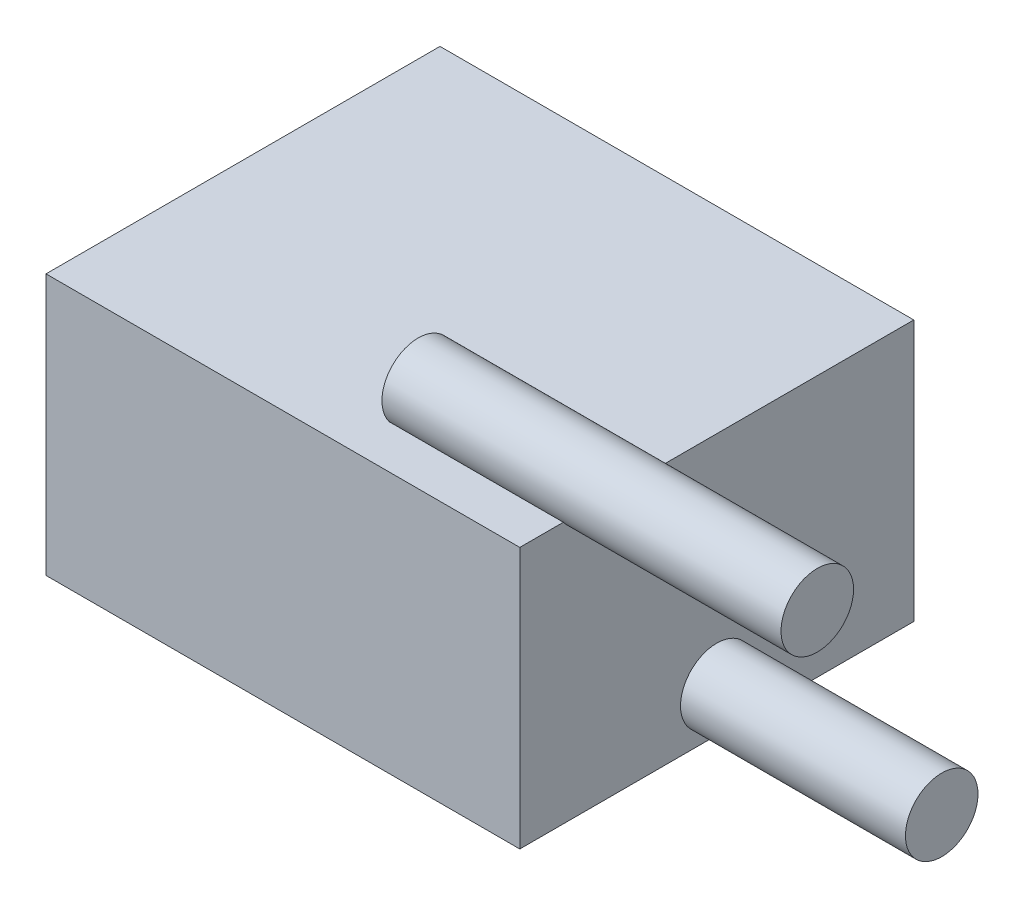
ISO-10303-21;
HEADER;
FILE_DESCRIPTION(('STEP AP214'),'2;1');
FILE_NAME('part.step','',(''),(''),'','','');
FILE_SCHEMA(('AUTOMOTIVE_DESIGN { 1 0 10303 214 1 1 1 1 }'));
ENDSEC;
DATA;
#1=APPLICATION_CONTEXT('core data for automotive mechanical design processes');
#2=APPLICATION_PROTOCOL_DEFINITION('international standard','automotive_design',2000,#1);
#3=PRODUCT_CONTEXT('',#1,'mechanical');
#4=PRODUCT('Part','Part','',(#3));
#5=PRODUCT_RELATED_PRODUCT_CATEGORY('part','',(#4));
#6=PRODUCT_DEFINITION_FORMATION('','',#4);
#7=PRODUCT_DEFINITION_CONTEXT('part definition',#1,'design');
#8=PRODUCT_DEFINITION('design','',#6,#7);
#9=PRODUCT_DEFINITION_SHAPE('','',#8);
#10=(LENGTH_UNIT() NAMED_UNIT(*) SI_UNIT(.MILLI.,.METRE.));
#11=(NAMED_UNIT(*) PLANE_ANGLE_UNIT() SI_UNIT($,.RADIAN.));
#12=(NAMED_UNIT(*) SI_UNIT($,.STERADIAN.) SOLID_ANGLE_UNIT());
#13=UNCERTAINTY_MEASURE_WITH_UNIT(LENGTH_MEASURE(1.E-05),#10,'distance_accuracy_value','');
#14=(GEOMETRIC_REPRESENTATION_CONTEXT(3) GLOBAL_UNCERTAINTY_ASSIGNED_CONTEXT((#13)) GLOBAL_UNIT_ASSIGNED_CONTEXT((#10,
#11,#12)) REPRESENTATION_CONTEXT('',''));
#15=CARTESIAN_POINT('',(0.,0.,0.));
#16=DIRECTION('',(0.,0.,1.));
#17=DIRECTION('',(1.,0.,0.));
#18=AXIS2_PLACEMENT_3D('',#15,#16,#17);
#19=CARTESIAN_POINT('',(-8.2931,9.144,6.8961));
#20=DIRECTION('',(1.,0.,0.));
#21=DIRECTION('',(0.,0.,-1.));
#22=AXIS2_PLACEMENT_3D('',#19,#20,#21);
#23=PLANE('',#22);
#24=DIRECTION('',(0.,0.,1.));
#25=VECTOR('',#24,1.);
#26=CARTESIAN_POINT('',(-8.2931,0.,6.8961));
#27=LINE('',#26,#25);
#28=CARTESIAN_POINT('',(-8.2931,0.,-6.8961));
#29=VERTEX_POINT('',#28);
#30=CARTESIAN_POINT('',(-8.2931,0.,6.8961));
#31=VERTEX_POINT('',#30);
#32=EDGE_CURVE('E120',#29,#31,#27,.T.);
#33=ORIENTED_EDGE('',*,*,#32,.T.);
#34=DIRECTION('',(0.,-1.,0.));
#35=VECTOR('',#34,1.);
#36=CARTESIAN_POINT('',(-8.2931,9.144,6.8961));
#37=LINE('',#36,#35);
#38=CARTESIAN_POINT('',(-8.2931,9.144,6.8961));
#39=VERTEX_POINT('',#38);
#40=EDGE_CURVE('E98',#39,#31,#37,.T.);
#41=ORIENTED_EDGE('',*,*,#40,.F.);
#42=DIRECTION('',(0.,0.,1.));
#43=VECTOR('',#42,1.);
#44=CARTESIAN_POINT('',(-8.2931,9.144,6.8961));
#45=LINE('',#44,#43);
#46=CARTESIAN_POINT('',(-8.2931,9.144,-6.8961));
#47=VERTEX_POINT('',#46);
#48=EDGE_CURVE('E129',#47,#39,#45,.T.);
#49=ORIENTED_EDGE('',*,*,#48,.F.);
#50=DIRECTION('',(0.,-1.,0.));
#51=VECTOR('',#50,1.);
#52=CARTESIAN_POINT('',(-8.2931,9.144,-6.8961));
#53=LINE('',#52,#51);
#54=EDGE_CURVE('E115',#47,#29,#53,.T.);
#55=ORIENTED_EDGE('',*,*,#54,.T.);
#56=EDGE_LOOP('',(#33,#41,#49,#55));
#57=FACE_BOUND('',#56,.T.);
#58=ADVANCED_FACE('F35',(#57),#23,.F.);
#59=CARTESIAN_POINT('',(8.2931,9.144,6.8961));
#60=DIRECTION('',(0.,0.,-1.));
#61=DIRECTION('',(-1.,0.,0.));
#62=AXIS2_PLACEMENT_3D('',#59,#60,#61);
#63=PLANE('',#62);
#64=DIRECTION('',(1.,0.,0.));
#65=VECTOR('',#64,1.);
#66=CARTESIAN_POINT('',(8.2931,0.,6.8961));
#67=LINE('',#66,#65);
#68=CARTESIAN_POINT('',(8.2931,0.,6.8961));
#69=VERTEX_POINT('',#68);
#70=EDGE_CURVE('E123',#31,#69,#67,.T.);
#71=ORIENTED_EDGE('',*,*,#70,.T.);
#72=DIRECTION('',(0.,-1.,0.));
#73=VECTOR('',#72,1.);
#74=CARTESIAN_POINT('',(8.2931,9.144,6.8961));
#75=LINE('',#74,#73);
#76=CARTESIAN_POINT('',(8.2931,9.144,6.8961));
#77=VERTEX_POINT('',#76);
#78=EDGE_CURVE('E133',#77,#69,#75,.T.);
#79=ORIENTED_EDGE('',*,*,#78,.F.);
#80=DIRECTION('',(1.,0.,0.));
#81=VECTOR('',#80,1.);
#82=CARTESIAN_POINT('',(8.2931,9.144,6.8961));
#83=LINE('',#82,#81);
#84=EDGE_CURVE('E86',#39,#77,#83,.T.);
#85=ORIENTED_EDGE('',*,*,#84,.F.);
#86=ORIENTED_EDGE('',*,*,#40,.T.);
#87=EDGE_LOOP('',(#71,#79,#85,#86));
#88=FACE_BOUND('',#87,.T.);
#89=ADVANCED_FACE('F149',(#88),#63,.F.);
#90=CARTESIAN_POINT('',(8.2931,9.144,6.8961));
#91=DIRECTION('',(-1.,0.,0.));
#92=DIRECTION('',(0.,0.,1.));
#93=AXIS2_PLACEMENT_3D('',#90,#91,#92);
#94=PLANE('',#93);
#95=CARTESIAN_POINT('',(8.2931,1.524,0.));
#96=DIRECTION('',(-1.,0.,0.));
#97=DIRECTION('',(0.,0.,1.));
#98=AXIS2_PLACEMENT_3D('',#95,#96,#97);
#99=CIRCLE('',#98,1.27);
#100=CARTESIAN_POINT('',(8.2931,1.524,1.27));
#101=VERTEX_POINT('',#100);
#102=EDGE_CURVE('E124',#101,#101,#99,.T.);
#103=ORIENTED_EDGE('',*,*,#102,.T.);
#104=EDGE_LOOP('',(#103));
#105=FACE_BOUND('',#104,.T.);
#106=DIRECTION('',(0.,0.,-1.));
#107=VECTOR('',#106,1.);
#108=CARTESIAN_POINT('',(8.2931,9.144,6.8961));
#109=LINE('',#108,#107);
#110=CARTESIAN_POINT('',(8.2931,9.144,3.3401));
#111=VERTEX_POINT('',#110);
#112=CARTESIAN_POINT('',(8.2931,9.144,-6.8961));
#113=VERTEX_POINT('',#112);
#114=EDGE_CURVE('E113',#111,#113,#109,.T.);
#115=ORIENTED_EDGE('',*,*,#114,.F.);
#116=CARTESIAN_POINT('',(8.2931,9.906,4.3561));
#117=DIRECTION('',(-1.,0.,0.));
#118=DIRECTION('',(0.,0.,1.));
#119=AXIS2_PLACEMENT_3D('',#116,#117,#118);
#120=CIRCLE('',#119,1.27);
#121=CARTESIAN_POINT('',(8.2931,9.144,5.3721));
#122=VERTEX_POINT('',#121);
#123=EDGE_CURVE('E104',#111,#122,#120,.T.);
#124=ORIENTED_EDGE('',*,*,#123,.T.);
#125=EDGE_CURVE('E110',#77,#122,#109,.T.);
#126=ORIENTED_EDGE('',*,*,#125,.F.);
#127=ORIENTED_EDGE('',*,*,#78,.T.);
#128=DIRECTION('',(0.,0.,-1.));
#129=VECTOR('',#128,1.);
#130=CARTESIAN_POINT('',(8.2931,0.,6.8961));
#131=LINE('',#130,#129);
#132=CARTESIAN_POINT('',(8.2931,0.,-6.8961));
#133=VERTEX_POINT('',#132);
#134=EDGE_CURVE('E126',#69,#133,#131,.T.);
#135=ORIENTED_EDGE('',*,*,#134,.T.);
#136=DIRECTION('',(0.,-1.,0.));
#137=VECTOR('',#136,1.);
#138=CARTESIAN_POINT('',(8.2931,9.144,-6.8961));
#139=LINE('',#138,#137);
#140=EDGE_CURVE('E131',#113,#133,#139,.T.);
#141=ORIENTED_EDGE('',*,*,#140,.F.);
#142=EDGE_LOOP('',(#115,#124,#126,#127,#135,#141));
#143=FACE_BOUND('',#142,.T.);
#144=ADVANCED_FACE('F153',(#105,#143),#94,.F.);
#145=CARTESIAN_POINT('',(8.2931,9.144,-6.8961));
#146=DIRECTION('',(0.,0.,1.));
#147=DIRECTION('',(1.,0.,0.));
#148=AXIS2_PLACEMENT_3D('',#145,#146,#147);
#149=PLANE('',#148);
#150=DIRECTION('',(-1.,0.,0.));
#151=VECTOR('',#150,1.);
#152=CARTESIAN_POINT('',(8.2931,0.,-6.8961));
#153=LINE('',#152,#151);
#154=EDGE_CURVE('E78',#133,#29,#153,.T.);
#155=ORIENTED_EDGE('',*,*,#154,.T.);
#156=ORIENTED_EDGE('',*,*,#54,.F.);
#157=DIRECTION('',(-1.,0.,0.));
#158=VECTOR('',#157,1.);
#159=CARTESIAN_POINT('',(8.2931,9.144,-6.8961));
#160=LINE('',#159,#158);
#161=EDGE_CURVE('E57',#113,#47,#160,.T.);
#162=ORIENTED_EDGE('',*,*,#161,.F.);
#163=ORIENTED_EDGE('',*,*,#140,.T.);
#164=EDGE_LOOP('',(#155,#156,#162,#163));
#165=FACE_BOUND('',#164,.T.);
#166=ADVANCED_FACE('F166',(#165),#149,.F.);
#167=CARTESIAN_POINT('',(0.,9.144,0.));
#168=DIRECTION('',(0.,1.,0.));
#169=DIRECTION('',(0.,0.,1.));
#170=AXIS2_PLACEMENT_3D('',#167,#168,#169);
#171=PLANE('',#170);
#172=DIRECTION('',(1.,0.,0.));
#173=VECTOR('',#172,1.);
#174=CARTESIAN_POINT('',(2.1971,9.144,5.3721));
#175=LINE('',#174,#173);
#176=CARTESIAN_POINT('',(2.1971,9.144,5.3721));
#177=VERTEX_POINT('',#176);
#178=EDGE_CURVE('E11',#177,#122,#175,.T.);
#179=ORIENTED_EDGE('',*,*,#178,.F.);
#180=DIRECTION('',(0.,0.,-1.));
#181=VECTOR('',#180,1.);
#182=CARTESIAN_POINT('',(2.1971,9.144,0.));
#183=LINE('',#182,#181);
#184=CARTESIAN_POINT('',(2.1971,9.144,3.3401));
#185=VERTEX_POINT('',#184);
#186=EDGE_CURVE('E94',#177,#185,#183,.T.);
#187=ORIENTED_EDGE('',*,*,#186,.T.);
#188=DIRECTION('',(1.,0.,0.));
#189=VECTOR('',#188,1.);
#190=CARTESIAN_POINT('',(2.1971,9.144,3.3401));
#191=LINE('',#190,#189);
#192=EDGE_CURVE('E42',#111,#185,#191,.F.);
#193=ORIENTED_EDGE('',*,*,#192,.F.);
#194=ORIENTED_EDGE('',*,*,#114,.T.);
#195=ORIENTED_EDGE('',*,*,#161,.T.);
#196=ORIENTED_EDGE('',*,*,#48,.T.);
#197=ORIENTED_EDGE('',*,*,#84,.T.);
#198=ORIENTED_EDGE('',*,*,#125,.T.);
#199=EDGE_LOOP('',(#179,#187,#193,#194,#195,#196,#197,#198));
#200=FACE_BOUND('',#199,.T.);
#201=ADVANCED_FACE('F108',(#200),#171,.T.);
#202=CARTESIAN_POINT('',(0.,0.,0.));
#203=DIRECTION('',(0.,1.,0.));
#204=DIRECTION('',(0.,0.,1.));
#205=AXIS2_PLACEMENT_3D('',#202,#203,#204);
#206=PLANE('',#205);
#207=ORIENTED_EDGE('',*,*,#32,.F.);
#208=ORIENTED_EDGE('',*,*,#154,.F.);
#209=ORIENTED_EDGE('',*,*,#134,.F.);
#210=ORIENTED_EDGE('',*,*,#70,.F.);
#211=EDGE_LOOP('',(#207,#208,#209,#210));
#212=FACE_BOUND('',#211,.T.);
#213=ADVANCED_FACE('F155',(#212),#206,.F.);
#214=CARTESIAN_POINT('',(2.1971,1.524,0.));
#215=DIRECTION('',(1.,0.,0.));
#216=DIRECTION('',(0.,0.,-1.));
#217=AXIS2_PLACEMENT_3D('',#214,#215,#216);
#218=CYLINDRICAL_SURFACE('',#217,1.27);
#219=CARTESIAN_POINT('',(16.1671,1.524,0.));
#220=DIRECTION('',(1.,0.,0.));
#221=DIRECTION('',(0.,0.,-1.));
#222=AXIS2_PLACEMENT_3D('',#219,#220,#221);
#223=CIRCLE('',#222,1.27);
#224=CARTESIAN_POINT('',(16.1671,1.524,-1.27));
#225=VERTEX_POINT('',#224);
#226=EDGE_CURVE('E137',#225,#225,#223,.T.);
#227=ORIENTED_EDGE('',*,*,#226,.F.);
#228=EDGE_LOOP('',(#227));
#229=FACE_BOUND('',#228,.T.);
#230=ORIENTED_EDGE('',*,*,#102,.F.);
#231=EDGE_LOOP('',(#230));
#232=FACE_BOUND('',#231,.T.);
#233=ADVANCED_FACE('F157',(#229,#232),#218,.T.);
#234=CARTESIAN_POINT('',(16.1671,1.524,0.));
#235=DIRECTION('',(1.,0.,0.));
#236=DIRECTION('',(0.,0.,-1.));
#237=AXIS2_PLACEMENT_3D('',#234,#235,#236);
#238=PLANE('',#237);
#239=ORIENTED_EDGE('',*,*,#226,.T.);
#240=EDGE_LOOP('',(#239));
#241=FACE_BOUND('',#240,.T.);
#242=ADVANCED_FACE('F163',(#241),#238,.T.);
#243=CARTESIAN_POINT('',(2.1971,9.906,4.3561));
#244=DIRECTION('',(1.,0.,0.));
#245=DIRECTION('',(0.,0.,-1.));
#246=AXIS2_PLACEMENT_3D('',#243,#244,#245);
#247=CYLINDRICAL_SURFACE('',#246,1.27);
#248=CARTESIAN_POINT('',(2.1971,9.906,4.3561));
#249=DIRECTION('',(1.,0.,0.));
#250=DIRECTION('',(0.,0.,-1.));
#251=AXIS2_PLACEMENT_3D('',#248,#249,#250);
#252=CIRCLE('',#251,1.27);
#253=EDGE_CURVE('E48',#185,#177,#252,.T.);
#254=ORIENTED_EDGE('',*,*,#253,.T.);
#255=ORIENTED_EDGE('',*,*,#178,.T.);
#256=ORIENTED_EDGE('',*,*,#123,.F.);
#257=ORIENTED_EDGE('',*,*,#192,.T.);
#258=EDGE_LOOP('',(#254,#255,#256,#257));
#259=FACE_BOUND('',#258,.T.);
#260=CARTESIAN_POINT('',(16.1671,9.906,4.3561));
#261=DIRECTION('',(1.,0.,0.));
#262=DIRECTION('',(0.,0.,-1.));
#263=AXIS2_PLACEMENT_3D('',#260,#261,#262);
#264=CIRCLE('',#263,1.27);
#265=CARTESIAN_POINT('',(16.1671,9.906,3.0861));
#266=VERTEX_POINT('',#265);
#267=EDGE_CURVE('E105',#266,#266,#264,.T.);
#268=ORIENTED_EDGE('',*,*,#267,.F.);
#269=EDGE_LOOP('',(#268));
#270=FACE_BOUND('',#269,.T.);
#271=ADVANCED_FACE('F101',(#259,#270),#247,.T.);
#272=CARTESIAN_POINT('',(2.1971,9.906,4.3561));
#273=DIRECTION('',(1.,0.,0.));
#274=DIRECTION('',(0.,0.,-1.));
#275=AXIS2_PLACEMENT_3D('',#272,#273,#274);
#276=PLANE('',#275);
#277=ORIENTED_EDGE('',*,*,#186,.F.);
#278=ORIENTED_EDGE('',*,*,#253,.F.);
#279=EDGE_LOOP('',(#277,#278));
#280=FACE_BOUND('',#279,.T.);
#281=ADVANCED_FACE('F95',(#280),#276,.F.);
#282=CARTESIAN_POINT('',(16.1671,9.906,4.3561));
#283=DIRECTION('',(1.,0.,0.));
#284=DIRECTION('',(0.,0.,-1.));
#285=AXIS2_PLACEMENT_3D('',#282,#283,#284);
#286=PLANE('',#285);
#287=ORIENTED_EDGE('',*,*,#267,.T.);
#288=EDGE_LOOP('',(#287));
#289=FACE_BOUND('',#288,.T.);
#290=ADVANCED_FACE('F220',(#289),#286,.T.);
#291=CLOSED_SHELL('',(#58,#89,#144,#166,#201,#213,#233,#242,#271,#281,#290));
#292=MANIFOLD_SOLID_BREP('B2',#291);
#293=ADVANCED_BREP_SHAPE_REPRESENTATION('',(#18,#292),#14);
#294=SHAPE_DEFINITION_REPRESENTATION(#9,#293);
ENDSEC;
END-ISO-10303-21;
